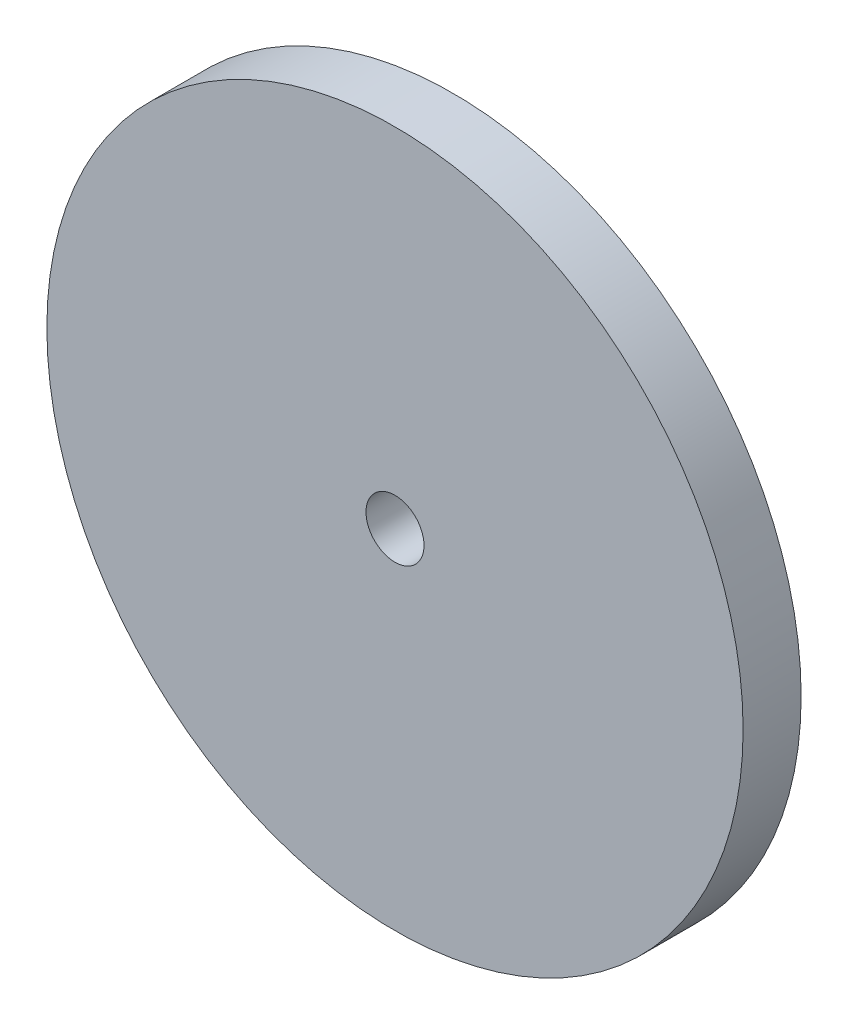
ISO-10303-21;
HEADER;
FILE_DESCRIPTION(('STEP AP214'),'2;1');
FILE_NAME('part.step','',(''),(''),'','','');
FILE_SCHEMA(('AUTOMOTIVE_DESIGN { 1 0 10303 214 1 1 1 1 }'));
ENDSEC;
DATA;
#1=APPLICATION_CONTEXT('core data for automotive mechanical design processes');
#2=APPLICATION_PROTOCOL_DEFINITION('international standard','automotive_design',2000,#1);
#3=PRODUCT_CONTEXT('',#1,'mechanical');
#4=PRODUCT('Part','Part','',(#3));
#5=PRODUCT_RELATED_PRODUCT_CATEGORY('part','',(#4));
#6=PRODUCT_DEFINITION_FORMATION('','',#4);
#7=PRODUCT_DEFINITION_CONTEXT('part definition',#1,'design');
#8=PRODUCT_DEFINITION('design','',#6,#7);
#9=PRODUCT_DEFINITION_SHAPE('','',#8);
#10=(LENGTH_UNIT() NAMED_UNIT(*) SI_UNIT(.MILLI.,.METRE.));
#11=(NAMED_UNIT(*) PLANE_ANGLE_UNIT() SI_UNIT($,.RADIAN.));
#12=(NAMED_UNIT(*) SI_UNIT($,.STERADIAN.) SOLID_ANGLE_UNIT());
#13=UNCERTAINTY_MEASURE_WITH_UNIT(LENGTH_MEASURE(1.E-05),#10,'distance_accuracy_value','');
#14=(GEOMETRIC_REPRESENTATION_CONTEXT(3) GLOBAL_UNCERTAINTY_ASSIGNED_CONTEXT((#13)) GLOBAL_UNIT_ASSIGNED_CONTEXT((#10,
#11,#12)) REPRESENTATION_CONTEXT('',''));
#15=CARTESIAN_POINT('',(0.,0.,0.));
#16=DIRECTION('',(0.,0.,1.));
#17=DIRECTION('',(1.,0.,0.));
#18=AXIS2_PLACEMENT_3D('',#15,#16,#17);
#19=CARTESIAN_POINT('',(0.,0.,5.));
#20=DIRECTION('',(0.,0.,-1.));
#21=DIRECTION('',(-1.,0.,0.));
#22=AXIS2_PLACEMENT_3D('',#19,#20,#21);
#23=CYLINDRICAL_SURFACE('',#22,30.);
#24=CARTESIAN_POINT('',(0.,0.,5.));
#25=DIRECTION('',(0.,0.,1.));
#26=DIRECTION('',(1.,0.,0.));
#27=AXIS2_PLACEMENT_3D('',#24,#25,#26);
#28=CIRCLE('',#27,30.);
#29=CARTESIAN_POINT('',(30.,0.,5.));
#30=VERTEX_POINT('',#29);
#31=EDGE_CURVE('E10',#30,#30,#28,.T.);
#32=ORIENTED_EDGE('',*,*,#31,.F.);
#33=EDGE_LOOP('',(#32));
#34=FACE_BOUND('',#33,.T.);
#35=CARTESIAN_POINT('',(0.,0.,0.));
#36=DIRECTION('',(0.,0.,1.));
#37=DIRECTION('',(1.,0.,0.));
#38=AXIS2_PLACEMENT_3D('',#35,#36,#37);
#39=CIRCLE('',#38,30.);
#40=CARTESIAN_POINT('',(30.,0.,0.));
#41=VERTEX_POINT('',#40);
#42=EDGE_CURVE('E34',#41,#41,#39,.T.);
#43=ORIENTED_EDGE('',*,*,#42,.T.);
#44=EDGE_LOOP('',(#43));
#45=FACE_BOUND('',#44,.T.);
#46=ADVANCED_FACE('F31',(#34,#45),#23,.T.);
#47=CARTESIAN_POINT('',(0.,0.,5.));
#48=DIRECTION('',(0.,0.,1.));
#49=DIRECTION('',(1.,0.,0.));
#50=AXIS2_PLACEMENT_3D('',#47,#48,#49);
#51=PLANE('',#50);
#52=CARTESIAN_POINT('',(0.,0.,5.));
#53=DIRECTION('',(0.,0.,1.));
#54=DIRECTION('',(1.,0.,0.));
#55=AXIS2_PLACEMENT_3D('',#52,#53,#54);
#56=CIRCLE('',#55,2.5);
#57=CARTESIAN_POINT('',(2.5,0.,5.));
#58=VERTEX_POINT('',#57);
#59=EDGE_CURVE('E43',#58,#58,#56,.T.);
#60=ORIENTED_EDGE('',*,*,#59,.F.);
#61=EDGE_LOOP('',(#60));
#62=FACE_BOUND('',#61,.T.);
#63=ORIENTED_EDGE('',*,*,#31,.T.);
#64=EDGE_LOOP('',(#63));
#65=FACE_BOUND('',#64,.T.);
#66=ADVANCED_FACE('F58',(#62,#65),#51,.T.);
#67=CARTESIAN_POINT('',(0.,0.,0.));
#68=DIRECTION('',(0.,0.,1.));
#69=DIRECTION('',(1.,0.,0.));
#70=AXIS2_PLACEMENT_3D('',#67,#68,#69);
#71=PLANE('',#70);
#72=CARTESIAN_POINT('',(0.,0.,0.));
#73=DIRECTION('',(0.,0.,1.));
#74=DIRECTION('',(1.,0.,0.));
#75=AXIS2_PLACEMENT_3D('',#72,#73,#74);
#76=CIRCLE('',#75,2.5);
#77=CARTESIAN_POINT('',(2.5,0.,0.));
#78=VERTEX_POINT('',#77);
#79=EDGE_CURVE('E41',#78,#78,#76,.T.);
#80=ORIENTED_EDGE('',*,*,#79,.T.);
#81=EDGE_LOOP('',(#80));
#82=FACE_BOUND('',#81,.T.);
#83=ORIENTED_EDGE('',*,*,#42,.F.);
#84=EDGE_LOOP('',(#83));
#85=FACE_BOUND('',#84,.T.);
#86=ADVANCED_FACE('F49',(#82,#85),#71,.F.);
#87=CARTESIAN_POINT('',(0.,0.,0.));
#88=DIRECTION('',(0.,0.,1.));
#89=DIRECTION('',(1.,0.,0.));
#90=AXIS2_PLACEMENT_3D('',#87,#88,#89);
#91=CYLINDRICAL_SURFACE('',#90,2.5);
#92=ORIENTED_EDGE('',*,*,#79,.F.);
#93=EDGE_LOOP('',(#92));
#94=FACE_BOUND('',#93,.T.);
#95=ORIENTED_EDGE('',*,*,#59,.T.);
#96=EDGE_LOOP('',(#95));
#97=FACE_BOUND('',#96,.T.);
#98=ADVANCED_FACE('F52',(#94,#97),#91,.F.);
#99=CLOSED_SHELL('',(#46,#66,#86,#98));
#100=MANIFOLD_SOLID_BREP('B2',#99);
#101=ADVANCED_BREP_SHAPE_REPRESENTATION('',(#18,#100),#14);
#102=SHAPE_DEFINITION_REPRESENTATION(#9,#101);
ENDSEC;
END-ISO-10303-21;
